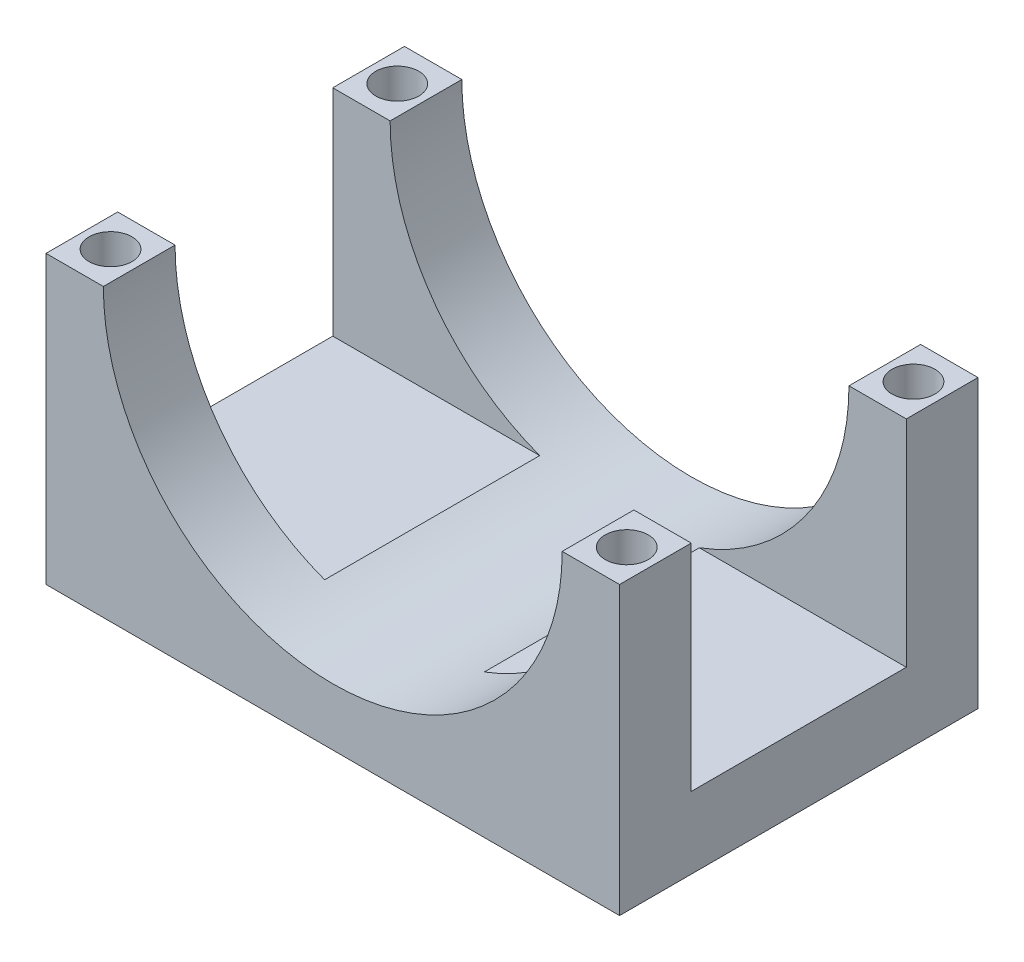
ISO-10303-21;
HEADER;
FILE_DESCRIPTION(('STEP AP214'),'2;1');
FILE_NAME('part.step','',(''),(''),'','','');
FILE_SCHEMA(('AUTOMOTIVE_DESIGN { 1 0 10303 214 1 1 1 1 }'));
ENDSEC;
DATA;
#1=APPLICATION_CONTEXT('core data for automotive mechanical design processes');
#2=APPLICATION_PROTOCOL_DEFINITION('international standard','automotive_design',2000,#1);
#3=PRODUCT_CONTEXT('',#1,'mechanical');
#4=PRODUCT('Part','Part','',(#3));
#5=PRODUCT_RELATED_PRODUCT_CATEGORY('part','',(#4));
#6=PRODUCT_DEFINITION_FORMATION('','',#4);
#7=PRODUCT_DEFINITION_CONTEXT('part definition',#1,'design');
#8=PRODUCT_DEFINITION('design','',#6,#7);
#9=PRODUCT_DEFINITION_SHAPE('','',#8);
#10=(LENGTH_UNIT() NAMED_UNIT(*) SI_UNIT(.MILLI.,.METRE.));
#11=(NAMED_UNIT(*) PLANE_ANGLE_UNIT() SI_UNIT($,.RADIAN.));
#12=(NAMED_UNIT(*) SI_UNIT($,.STERADIAN.) SOLID_ANGLE_UNIT());
#13=UNCERTAINTY_MEASURE_WITH_UNIT(LENGTH_MEASURE(1.E-05),#10,'distance_accuracy_value','');
#14=(GEOMETRIC_REPRESENTATION_CONTEXT(3) GLOBAL_UNCERTAINTY_ASSIGNED_CONTEXT((#13)) GLOBAL_UNIT_ASSIGNED_CONTEXT((#10,
#11,#12)) REPRESENTATION_CONTEXT('',''));
#15=CARTESIAN_POINT('',(0.,0.,0.));
#16=DIRECTION('',(0.,0.,1.));
#17=DIRECTION('',(1.,0.,0.));
#18=AXIS2_PLACEMENT_3D('',#15,#16,#17);
#19=CARTESIAN_POINT('',(0.,20.,0.));
#20=DIRECTION('',(0.,-1.,0.));
#21=DIRECTION('',(0.,0.,-1.));
#22=AXIS2_PLACEMENT_3D('',#19,#20,#21);
#23=PLANE('',#22);
#24=CARTESIAN_POINT('',(38.,20.,-22.5));
#25=DIRECTION('',(0.,1.,0.));
#26=DIRECTION('',(0.,0.,1.));
#27=AXIS2_PLACEMENT_3D('',#24,#25,#26);
#28=CIRCLE('',#27,1.5);
#29=CARTESIAN_POINT('',(38.,20.,-21.));
#30=VERTEX_POINT('',#29);
#31=EDGE_CURVE('E236',#30,#30,#28,.T.);
#32=ORIENTED_EDGE('',*,*,#31,.F.);
#33=EDGE_LOOP('',(#32));
#34=FACE_BOUND('',#33,.T.);
#35=DIRECTION('',(0.,0.,1.));
#36=VECTOR('',#35,1.);
#37=CARTESIAN_POINT('',(36.,20.,-25.));
#38=LINE('',#37,#36);
#39=CARTESIAN_POINT('',(36.,20.,-25.));
#40=VERTEX_POINT('',#39);
#41=CARTESIAN_POINT('',(36.,20.,-20.));
#42=VERTEX_POINT('',#41);
#43=EDGE_CURVE('E199',#40,#42,#38,.T.);
#44=ORIENTED_EDGE('',*,*,#43,.T.);
#45=DIRECTION('',(1.,0.,0.));
#46=VECTOR('',#45,1.);
#47=CARTESIAN_POINT('',(0.,20.,-20.));
#48=LINE('',#47,#46);
#49=CARTESIAN_POINT('',(40.,20.,-20.));
#50=VERTEX_POINT('',#49);
#51=EDGE_CURVE('E223',#42,#50,#48,.T.);
#52=ORIENTED_EDGE('',*,*,#51,.T.);
#53=DIRECTION('',(0.,0.,-1.));
#54=VECTOR('',#53,1.);
#55=CARTESIAN_POINT('',(40.,20.,0.));
#56=LINE('',#55,#54);
#57=CARTESIAN_POINT('',(40.,20.,-25.));
#58=VERTEX_POINT('',#57);
#59=EDGE_CURVE('E172',#50,#58,#56,.T.);
#60=ORIENTED_EDGE('',*,*,#59,.T.);
#61=DIRECTION('',(-1.,0.,0.));
#62=VECTOR('',#61,1.);
#63=CARTESIAN_POINT('',(0.,20.,-25.));
#64=LINE('',#63,#62);
#65=EDGE_CURVE('E177',#58,#40,#64,.T.);
#66=ORIENTED_EDGE('',*,*,#65,.T.);
#67=EDGE_LOOP('',(#44,#52,#60,#66));
#68=FACE_BOUND('',#67,.T.);
#69=ADVANCED_FACE('F35',(#34,#68),#23,.F.);
#70=CARTESIAN_POINT('',(2.,20.,-22.5));
#71=DIRECTION('',(0.,1.,0.));
#72=DIRECTION('',(0.,0.,1.));
#73=AXIS2_PLACEMENT_3D('',#70,#71,#72);
#74=CIRCLE('',#73,1.5);
#75=CARTESIAN_POINT('',(2.,20.,-21.));
#76=VERTEX_POINT('',#75);
#77=EDGE_CURVE('E243',#76,#76,#74,.T.);
#78=ORIENTED_EDGE('',*,*,#77,.F.);
#79=EDGE_LOOP('',(#78));
#80=FACE_BOUND('',#79,.T.);
#81=DIRECTION('',(0.,0.,1.));
#82=VECTOR('',#81,1.);
#83=CARTESIAN_POINT('',(0.,20.,0.));
#84=LINE('',#83,#82);
#85=CARTESIAN_POINT('',(0.,20.,-25.));
#86=VERTEX_POINT('',#85);
#87=CARTESIAN_POINT('',(0.,20.,-20.));
#88=VERTEX_POINT('',#87);
#89=EDGE_CURVE('E159',#86,#88,#84,.T.);
#90=ORIENTED_EDGE('',*,*,#89,.T.);
#91=CARTESIAN_POINT('',(3.99999999999999,20.,-20.));
#92=VERTEX_POINT('',#91);
#93=EDGE_CURVE('E227',#88,#92,#48,.T.);
#94=ORIENTED_EDGE('',*,*,#93,.T.);
#95=DIRECTION('',(0.,0.,1.));
#96=VECTOR('',#95,1.);
#97=CARTESIAN_POINT('',(3.99999999999999,20.,-25.));
#98=LINE('',#97,#96);
#99=CARTESIAN_POINT('',(3.99999999999999,20.,-25.));
#100=VERTEX_POINT('',#99);
#101=EDGE_CURVE('E196',#92,#100,#98,.F.);
#102=ORIENTED_EDGE('',*,*,#101,.T.);
#103=EDGE_CURVE('E176',#100,#86,#64,.T.);
#104=ORIENTED_EDGE('',*,*,#103,.T.);
#105=EDGE_LOOP('',(#90,#94,#102,#104));
#106=FACE_BOUND('',#105,.T.);
#107=ADVANCED_FACE('F306',(#80,#106),#23,.F.);
#108=CARTESIAN_POINT('',(38.,20.,-2.5));
#109=DIRECTION('',(0.,1.,0.));
#110=DIRECTION('',(0.,0.,1.));
#111=AXIS2_PLACEMENT_3D('',#108,#109,#110);
#112=CIRCLE('',#111,1.5);
#113=CARTESIAN_POINT('',(38.,20.,-0.999999999999996));
#114=VERTEX_POINT('',#113);
#115=EDGE_CURVE('E235',#114,#114,#112,.T.);
#116=ORIENTED_EDGE('',*,*,#115,.F.);
#117=EDGE_LOOP('',(#116));
#118=FACE_BOUND('',#117,.T.);
#119=CARTESIAN_POINT('',(40.,20.,0.));
#120=VERTEX_POINT('',#119);
#121=CARTESIAN_POINT('',(40.,20.,-5.));
#122=VERTEX_POINT('',#121);
#123=EDGE_CURVE('E173',#120,#122,#56,.T.);
#124=ORIENTED_EDGE('',*,*,#123,.T.);
#125=DIRECTION('',(1.,0.,0.));
#126=VECTOR('',#125,1.);
#127=CARTESIAN_POINT('',(0.,20.,-5.));
#128=LINE('',#127,#126);
#129=CARTESIAN_POINT('',(36.,20.,-5.));
#130=VERTEX_POINT('',#129);
#131=EDGE_CURVE('E153',#130,#122,#128,.T.);
#132=ORIENTED_EDGE('',*,*,#131,.F.);
#133=CARTESIAN_POINT('',(36.,20.,0.));
#134=VERTEX_POINT('',#133);
#135=EDGE_CURVE('E198',#130,#134,#38,.T.);
#136=ORIENTED_EDGE('',*,*,#135,.T.);
#137=DIRECTION('',(1.,0.,0.));
#138=VECTOR('',#137,1.);
#139=CARTESIAN_POINT('',(0.,20.,0.));
#140=LINE('',#139,#138);
#141=EDGE_CURVE('E163',#134,#120,#140,.T.);
#142=ORIENTED_EDGE('',*,*,#141,.T.);
#143=EDGE_LOOP('',(#124,#132,#136,#142));
#144=FACE_BOUND('',#143,.T.);
#145=ADVANCED_FACE('F269',(#118,#144),#23,.F.);
#146=CARTESIAN_POINT('',(0.,20.,0.));
#147=DIRECTION('',(1.,0.,0.));
#148=DIRECTION('',(0.,0.,-1.));
#149=AXIS2_PLACEMENT_3D('',#146,#147,#148);
#150=PLANE('',#149);
#151=DIRECTION('',(0.,0.,-1.));
#152=VECTOR('',#151,1.);
#153=CARTESIAN_POINT('',(0.,5.,-5.));
#154=LINE('',#153,#152);
#155=CARTESIAN_POINT('',(0.,5.,-5.));
#156=VERTEX_POINT('',#155);
#157=CARTESIAN_POINT('',(0.,5.,-20.));
#158=VERTEX_POINT('',#157);
#159=EDGE_CURVE('E143',#156,#158,#154,.T.);
#160=ORIENTED_EDGE('',*,*,#159,.T.);
#161=DIRECTION('',(0.,1.,0.));
#162=VECTOR('',#161,1.);
#163=CARTESIAN_POINT('',(0.,5.,-20.));
#164=LINE('',#163,#162);
#165=EDGE_CURVE('E222',#158,#88,#164,.T.);
#166=ORIENTED_EDGE('',*,*,#165,.T.);
#167=ORIENTED_EDGE('',*,*,#89,.F.);
#168=DIRECTION('',(0.,-1.,0.));
#169=VECTOR('',#168,1.);
#170=CARTESIAN_POINT('',(0.,20.,-25.));
#171=LINE('',#170,#169);
#172=CARTESIAN_POINT('',(0.,0.,-25.));
#173=VERTEX_POINT('',#172);
#174=EDGE_CURVE('E180',#86,#173,#171,.T.);
#175=ORIENTED_EDGE('',*,*,#174,.T.);
#176=DIRECTION('',(0.,0.,1.));
#177=VECTOR('',#176,1.);
#178=CARTESIAN_POINT('',(0.,0.,0.));
#179=LINE('',#178,#177);
#180=CARTESIAN_POINT('',(0.,0.,0.));
#181=VERTEX_POINT('',#180);
#182=EDGE_CURVE('E181',#173,#181,#179,.T.);
#183=ORIENTED_EDGE('',*,*,#182,.T.);
#184=DIRECTION('',(0.,-1.,0.));
#185=VECTOR('',#184,1.);
#186=CARTESIAN_POINT('',(0.,20.,0.));
#187=LINE('',#186,#185);
#188=CARTESIAN_POINT('',(0.,20.,0.));
#189=VERTEX_POINT('',#188);
#190=EDGE_CURVE('E158',#189,#181,#187,.T.);
#191=ORIENTED_EDGE('',*,*,#190,.F.);
#192=CARTESIAN_POINT('',(0.,20.,-5.));
#193=VERTEX_POINT('',#192);
#194=EDGE_CURVE('E150',#193,#189,#84,.T.);
#195=ORIENTED_EDGE('',*,*,#194,.F.);
#196=DIRECTION('',(0.,-1.,0.));
#197=VECTOR('',#196,1.);
#198=CARTESIAN_POINT('',(0.,20.,-5.));
#199=LINE('',#198,#197);
#200=EDGE_CURVE('E135',#193,#156,#199,.T.);
#201=ORIENTED_EDGE('',*,*,#200,.T.);
#202=EDGE_LOOP('',(#160,#166,#167,#175,#183,#191,#195,#201));
#203=FACE_BOUND('',#202,.T.);
#204=ADVANCED_FACE('F37',(#203),#150,.F.);
#205=CARTESIAN_POINT('',(0.,20.,0.));
#206=DIRECTION('',(0.,0.,-1.));
#207=DIRECTION('',(-1.,0.,0.));
#208=AXIS2_PLACEMENT_3D('',#205,#206,#207);
#209=PLANE('',#208);
#210=ORIENTED_EDGE('',*,*,#141,.F.);
#211=CARTESIAN_POINT('',(20.,20.,0.));
#212=DIRECTION('',(0.,0.,1.));
#213=DIRECTION('',(1.,0.,0.));
#214=AXIS2_PLACEMENT_3D('',#211,#212,#213);
#215=CIRCLE('',#214,16.);
#216=CARTESIAN_POINT('',(3.99999999999999,20.,0.));
#217=VERTEX_POINT('',#216);
#218=EDGE_CURVE('E168',#217,#134,#215,.T.);
#219=ORIENTED_EDGE('',*,*,#218,.F.);
#220=EDGE_CURVE('E170',#189,#217,#140,.T.);
#221=ORIENTED_EDGE('',*,*,#220,.F.);
#222=ORIENTED_EDGE('',*,*,#190,.T.);
#223=DIRECTION('',(1.,0.,0.));
#224=VECTOR('',#223,1.);
#225=CARTESIAN_POINT('',(0.,0.,0.));
#226=LINE('',#225,#224);
#227=CARTESIAN_POINT('',(40.,0.,0.));
#228=VERTEX_POINT('',#227);
#229=EDGE_CURVE('E183',#181,#228,#226,.T.);
#230=ORIENTED_EDGE('',*,*,#229,.T.);
#231=DIRECTION('',(0.,-1.,0.));
#232=VECTOR('',#231,1.);
#233=CARTESIAN_POINT('',(40.,20.,0.));
#234=LINE('',#233,#232);
#235=EDGE_CURVE('E192',#120,#228,#234,.T.);
#236=ORIENTED_EDGE('',*,*,#235,.F.);
#237=EDGE_LOOP('',(#210,#219,#221,#222,#230,#236));
#238=FACE_BOUND('',#237,.T.);
#239=ADVANCED_FACE('F266',(#238),#209,.F.);
#240=CARTESIAN_POINT('',(40.,20.,0.));
#241=DIRECTION('',(-1.,0.,0.));
#242=DIRECTION('',(0.,0.,1.));
#243=AXIS2_PLACEMENT_3D('',#240,#241,#242);
#244=PLANE('',#243);
#245=ORIENTED_EDGE('',*,*,#59,.F.);
#246=DIRECTION('',(0.,1.,0.));
#247=VECTOR('',#246,1.);
#248=CARTESIAN_POINT('',(40.,5.,-20.));
#249=LINE('',#248,#247);
#250=CARTESIAN_POINT('',(40.,5.,-20.));
#251=VERTEX_POINT('',#250);
#252=EDGE_CURVE('E144',#251,#50,#249,.T.);
#253=ORIENTED_EDGE('',*,*,#252,.F.);
#254=DIRECTION('',(0.,0.,-1.));
#255=VECTOR('',#254,1.);
#256=CARTESIAN_POINT('',(40.,5.,-5.));
#257=LINE('',#256,#255);
#258=CARTESIAN_POINT('',(40.,5.,-5.));
#259=VERTEX_POINT('',#258);
#260=EDGE_CURVE('E278',#259,#251,#257,.T.);
#261=ORIENTED_EDGE('',*,*,#260,.F.);
#262=DIRECTION('',(0.,-1.,0.));
#263=VECTOR('',#262,1.);
#264=CARTESIAN_POINT('',(40.,20.,-5.));
#265=LINE('',#264,#263);
#266=EDGE_CURVE('E276',#122,#259,#265,.T.);
#267=ORIENTED_EDGE('',*,*,#266,.F.);
#268=ORIENTED_EDGE('',*,*,#123,.F.);
#269=ORIENTED_EDGE('',*,*,#235,.T.);
#270=DIRECTION('',(0.,0.,-1.));
#271=VECTOR('',#270,1.);
#272=CARTESIAN_POINT('',(40.,0.,0.));
#273=LINE('',#272,#271);
#274=CARTESIAN_POINT('',(40.,0.,-25.));
#275=VERTEX_POINT('',#274);
#276=EDGE_CURVE('E164',#228,#275,#273,.T.);
#277=ORIENTED_EDGE('',*,*,#276,.T.);
#278=DIRECTION('',(0.,-1.,0.));
#279=VECTOR('',#278,1.);
#280=CARTESIAN_POINT('',(40.,20.,-25.));
#281=LINE('',#280,#279);
#282=EDGE_CURVE('E189',#58,#275,#281,.T.);
#283=ORIENTED_EDGE('',*,*,#282,.F.);
#284=EDGE_LOOP('',(#245,#253,#261,#267,#268,#269,#277,#283));
#285=FACE_BOUND('',#284,.T.);
#286=ADVANCED_FACE('F289',(#285),#244,.F.);
#287=CARTESIAN_POINT('',(0.,20.,-25.));
#288=DIRECTION('',(0.,0.,1.));
#289=DIRECTION('',(1.,0.,0.));
#290=AXIS2_PLACEMENT_3D('',#287,#288,#289);
#291=PLANE('',#290);
#292=ORIENTED_EDGE('',*,*,#103,.F.);
#293=CARTESIAN_POINT('',(20.,20.,-25.));
#294=DIRECTION('',(0.,0.,1.));
#295=DIRECTION('',(1.,0.,0.));
#296=AXIS2_PLACEMENT_3D('',#293,#294,#295);
#297=CIRCLE('',#296,16.);
#298=EDGE_CURVE('E184',#100,#40,#297,.T.);
#299=ORIENTED_EDGE('',*,*,#298,.T.);
#300=ORIENTED_EDGE('',*,*,#65,.F.);
#301=ORIENTED_EDGE('',*,*,#282,.T.);
#302=DIRECTION('',(-1.,0.,0.));
#303=VECTOR('',#302,1.);
#304=CARTESIAN_POINT('',(0.,0.,-25.));
#305=LINE('',#304,#303);
#306=EDGE_CURVE('E160',#275,#173,#305,.T.);
#307=ORIENTED_EDGE('',*,*,#306,.T.);
#308=ORIENTED_EDGE('',*,*,#174,.F.);
#309=EDGE_LOOP('',(#292,#299,#300,#301,#307,#308));
#310=FACE_BOUND('',#309,.T.);
#311=ADVANCED_FACE('F292',(#310),#291,.F.);
#312=CARTESIAN_POINT('',(2.,20.,-2.5));
#313=DIRECTION('',(0.,1.,0.));
#314=DIRECTION('',(0.,0.,1.));
#315=AXIS2_PLACEMENT_3D('',#312,#313,#314);
#316=CIRCLE('',#315,1.5);
#317=CARTESIAN_POINT('',(2.,20.,-1.));
#318=VERTEX_POINT('',#317);
#319=EDGE_CURVE('E242',#318,#318,#316,.T.);
#320=ORIENTED_EDGE('',*,*,#319,.F.);
#321=EDGE_LOOP('',(#320));
#322=FACE_BOUND('',#321,.T.);
#323=CARTESIAN_POINT('',(3.99999999999999,20.,-5.));
#324=VERTEX_POINT('',#323);
#325=EDGE_CURVE('E152',#217,#324,#98,.F.);
#326=ORIENTED_EDGE('',*,*,#325,.T.);
#327=EDGE_CURVE('E59',#193,#324,#128,.T.);
#328=ORIENTED_EDGE('',*,*,#327,.F.);
#329=ORIENTED_EDGE('',*,*,#194,.T.);
#330=ORIENTED_EDGE('',*,*,#220,.T.);
#331=EDGE_LOOP('',(#326,#328,#329,#330));
#332=FACE_BOUND('',#331,.T.);
#333=ADVANCED_FACE('F148',(#322,#332),#23,.F.);
#334=CARTESIAN_POINT('',(0.,0.,0.));
#335=DIRECTION('',(0.,-1.,0.));
#336=DIRECTION('',(0.,0.,-1.));
#337=AXIS2_PLACEMENT_3D('',#334,#335,#336);
#338=PLANE('',#337);
#339=CARTESIAN_POINT('',(2.,0.,-22.5));
#340=DIRECTION('',(0.,1.,0.));
#341=DIRECTION('',(0.,0.,1.));
#342=AXIS2_PLACEMENT_3D('',#339,#340,#341);
#343=CIRCLE('',#342,1.5);
#344=CARTESIAN_POINT('',(2.,0.,-21.));
#345=VERTEX_POINT('',#344);
#346=EDGE_CURVE('E239',#345,#345,#343,.T.);
#347=ORIENTED_EDGE('',*,*,#346,.T.);
#348=EDGE_LOOP('',(#347));
#349=FACE_BOUND('',#348,.T.);
#350=CARTESIAN_POINT('',(38.,0.,-2.5));
#351=DIRECTION('',(0.,1.,0.));
#352=DIRECTION('',(0.,0.,1.));
#353=AXIS2_PLACEMENT_3D('',#350,#351,#352);
#354=CIRCLE('',#353,1.5);
#355=CARTESIAN_POINT('',(38.,0.,-0.999999999999996));
#356=VERTEX_POINT('',#355);
#357=EDGE_CURVE('E246',#356,#356,#354,.T.);
#358=ORIENTED_EDGE('',*,*,#357,.T.);
#359=EDGE_LOOP('',(#358));
#360=FACE_BOUND('',#359,.T.);
#361=CARTESIAN_POINT('',(38.,0.,-22.5));
#362=DIRECTION('',(0.,1.,0.));
#363=DIRECTION('',(0.,0.,1.));
#364=AXIS2_PLACEMENT_3D('',#361,#362,#363);
#365=CIRCLE('',#364,1.5);
#366=CARTESIAN_POINT('',(38.,0.,-21.));
#367=VERTEX_POINT('',#366);
#368=EDGE_CURVE('E232',#367,#367,#365,.T.);
#369=ORIENTED_EDGE('',*,*,#368,.T.);
#370=EDGE_LOOP('',(#369));
#371=FACE_BOUND('',#370,.T.);
#372=CARTESIAN_POINT('',(2.,0.,-2.5));
#373=DIRECTION('',(0.,1.,0.));
#374=DIRECTION('',(0.,0.,1.));
#375=AXIS2_PLACEMENT_3D('',#372,#373,#374);
#376=CIRCLE('',#375,1.5);
#377=CARTESIAN_POINT('',(2.,0.,-1.));
#378=VERTEX_POINT('',#377);
#379=EDGE_CURVE('E251',#378,#378,#376,.T.);
#380=ORIENTED_EDGE('',*,*,#379,.T.);
#381=EDGE_LOOP('',(#380));
#382=FACE_BOUND('',#381,.T.);
#383=ORIENTED_EDGE('',*,*,#182,.F.);
#384=ORIENTED_EDGE('',*,*,#306,.F.);
#385=ORIENTED_EDGE('',*,*,#276,.F.);
#386=ORIENTED_EDGE('',*,*,#229,.F.);
#387=EDGE_LOOP('',(#383,#384,#385,#386));
#388=FACE_BOUND('',#387,.T.);
#389=ADVANCED_FACE('F300',(#349,#360,#371,#382,#388),#338,.T.);
#390=CARTESIAN_POINT('',(20.,20.,-25.));
#391=DIRECTION('',(0.,0.,1.));
#392=DIRECTION('',(1.,0.,0.));
#393=AXIS2_PLACEMENT_3D('',#390,#391,#392);
#394=CYLINDRICAL_SURFACE('',#393,16.);
#395=ORIENTED_EDGE('',*,*,#101,.F.);
#396=CARTESIAN_POINT('',(20.,20.,-20.));
#397=DIRECTION('',(0.,0.,-1.));
#398=DIRECTION('',(-1.,0.,0.));
#399=AXIS2_PLACEMENT_3D('',#396,#397,#398);
#400=CIRCLE('',#399,16.);
#401=CARTESIAN_POINT('',(14.43223563717,5.,-20.));
#402=VERTEX_POINT('',#401);
#403=EDGE_CURVE('E11',#92,#402,#400,.F.);
#404=ORIENTED_EDGE('',*,*,#403,.T.);
#405=DIRECTION('',(0.,0.,1.));
#406=VECTOR('',#405,1.);
#407=CARTESIAN_POINT('',(14.43223563717,5.,-25.));
#408=LINE('',#407,#406);
#409=CARTESIAN_POINT('',(14.43223563717,5.,-5.));
#410=VERTEX_POINT('',#409);
#411=EDGE_CURVE('E39',#402,#410,#408,.T.);
#412=ORIENTED_EDGE('',*,*,#411,.T.);
#413=CARTESIAN_POINT('',(20.,20.,-5.));
#414=DIRECTION('',(0.,0.,1.));
#415=DIRECTION('',(0.,-1.,0.));
#416=AXIS2_PLACEMENT_3D('',#413,#414,#415);
#417=CIRCLE('',#416,16.);
#418=EDGE_CURVE('E206',#410,#324,#417,.F.);
#419=ORIENTED_EDGE('',*,*,#418,.T.);
#420=ORIENTED_EDGE('',*,*,#325,.F.);
#421=ORIENTED_EDGE('',*,*,#218,.T.);
#422=ORIENTED_EDGE('',*,*,#135,.F.);
#423=CARTESIAN_POINT('',(25.56776436283,5.,-5.));
#424=VERTEX_POINT('',#423);
#425=EDGE_CURVE('E202',#130,#424,#417,.F.);
#426=ORIENTED_EDGE('',*,*,#425,.T.);
#427=DIRECTION('',(0.,0.,1.));
#428=VECTOR('',#427,1.);
#429=CARTESIAN_POINT('',(25.56776436283,5.,-25.));
#430=LINE('',#429,#428);
#431=CARTESIAN_POINT('',(25.56776436283,5.,-20.));
#432=VERTEX_POINT('',#431);
#433=EDGE_CURVE('E205',#424,#432,#430,.F.);
#434=ORIENTED_EDGE('',*,*,#433,.T.);
#435=EDGE_CURVE('E44',#432,#42,#400,.F.);
#436=ORIENTED_EDGE('',*,*,#435,.T.);
#437=ORIENTED_EDGE('',*,*,#43,.F.);
#438=ORIENTED_EDGE('',*,*,#298,.F.);
#439=EDGE_LOOP('',(#395,#404,#412,#419,#420,#421,#422,#426,#434,#436,#437,#438));
#440=FACE_BOUND('',#439,.T.);
#441=ADVANCED_FACE('F212',(#440),#394,.F.);
#442=CARTESIAN_POINT('',(2.,0.,-2.5));
#443=DIRECTION('',(0.,1.,0.));
#444=DIRECTION('',(0.,0.,1.));
#445=AXIS2_PLACEMENT_3D('',#442,#443,#444);
#446=CYLINDRICAL_SURFACE('',#445,1.5);
#447=ORIENTED_EDGE('',*,*,#379,.F.);
#448=EDGE_LOOP('',(#447));
#449=FACE_BOUND('',#448,.T.);
#450=ORIENTED_EDGE('',*,*,#319,.T.);
#451=EDGE_LOOP('',(#450));
#452=FACE_BOUND('',#451,.T.);
#453=ADVANCED_FACE('F320',(#449,#452),#446,.F.);
#454=CARTESIAN_POINT('',(38.,0.,-22.5));
#455=DIRECTION('',(0.,1.,0.));
#456=DIRECTION('',(0.,0.,1.));
#457=AXIS2_PLACEMENT_3D('',#454,#455,#456);
#458=CYLINDRICAL_SURFACE('',#457,1.5);
#459=ORIENTED_EDGE('',*,*,#368,.F.);
#460=EDGE_LOOP('',(#459));
#461=FACE_BOUND('',#460,.T.);
#462=ORIENTED_EDGE('',*,*,#31,.T.);
#463=EDGE_LOOP('',(#462));
#464=FACE_BOUND('',#463,.T.);
#465=ADVANCED_FACE('F431',(#461,#464),#458,.F.);
#466=CARTESIAN_POINT('',(38.,0.,-2.5));
#467=DIRECTION('',(0.,1.,0.));
#468=DIRECTION('',(0.,0.,1.));
#469=AXIS2_PLACEMENT_3D('',#466,#467,#468);
#470=CYLINDRICAL_SURFACE('',#469,1.5);
#471=ORIENTED_EDGE('',*,*,#357,.F.);
#472=EDGE_LOOP('',(#471));
#473=FACE_BOUND('',#472,.T.);
#474=ORIENTED_EDGE('',*,*,#115,.T.);
#475=EDGE_LOOP('',(#474));
#476=FACE_BOUND('',#475,.T.);
#477=ADVANCED_FACE('F342',(#473,#476),#470,.F.);
#478=CARTESIAN_POINT('',(2.,0.,-22.5));
#479=DIRECTION('',(0.,1.,0.));
#480=DIRECTION('',(0.,0.,1.));
#481=AXIS2_PLACEMENT_3D('',#478,#479,#480);
#482=CYLINDRICAL_SURFACE('',#481,1.5);
#483=ORIENTED_EDGE('',*,*,#346,.F.);
#484=EDGE_LOOP('',(#483));
#485=FACE_BOUND('',#484,.T.);
#486=ORIENTED_EDGE('',*,*,#77,.T.);
#487=EDGE_LOOP('',(#486));
#488=FACE_BOUND('',#487,.T.);
#489=ADVANCED_FACE('F334',(#485,#488),#482,.F.);
#490=CARTESIAN_POINT('',(0.,20.,-5.));
#491=DIRECTION('',(0.,0.,1.));
#492=DIRECTION('',(0.,-1.,0.));
#493=AXIS2_PLACEMENT_3D('',#490,#491,#492);
#494=PLANE('',#493);
#495=ORIENTED_EDGE('',*,*,#131,.T.);
#496=ORIENTED_EDGE('',*,*,#266,.T.);
#497=DIRECTION('',(1.,0.,0.));
#498=VECTOR('',#497,1.);
#499=CARTESIAN_POINT('',(0.,5.,-5.));
#500=LINE('',#499,#498);
#501=EDGE_CURVE('E51',#424,#259,#500,.T.);
#502=ORIENTED_EDGE('',*,*,#501,.F.);
#503=ORIENTED_EDGE('',*,*,#425,.F.);
#504=EDGE_LOOP('',(#495,#496,#502,#503));
#505=FACE_BOUND('',#504,.T.);
#506=ADVANCED_FACE('F331',(#505),#494,.F.);
#507=CARTESIAN_POINT('',(0.,5.,-5.));
#508=DIRECTION('',(0.,-1.,0.));
#509=DIRECTION('',(0.,0.,-1.));
#510=AXIS2_PLACEMENT_3D('',#507,#508,#509);
#511=PLANE('',#510);
#512=ORIENTED_EDGE('',*,*,#501,.T.);
#513=ORIENTED_EDGE('',*,*,#260,.T.);
#514=DIRECTION('',(1.,0.,0.));
#515=VECTOR('',#514,1.);
#516=CARTESIAN_POINT('',(0.,5.,-20.));
#517=LINE('',#516,#515);
#518=EDGE_CURVE('E224',#432,#251,#517,.T.);
#519=ORIENTED_EDGE('',*,*,#518,.F.);
#520=ORIENTED_EDGE('',*,*,#433,.F.);
#521=EDGE_LOOP('',(#512,#513,#519,#520));
#522=FACE_BOUND('',#521,.T.);
#523=ADVANCED_FACE('F333',(#522),#511,.F.);
#524=CARTESIAN_POINT('',(0.,5.,-20.));
#525=DIRECTION('',(0.,0.,-1.));
#526=DIRECTION('',(-1.,0.,0.));
#527=AXIS2_PLACEMENT_3D('',#524,#525,#526);
#528=PLANE('',#527);
#529=ORIENTED_EDGE('',*,*,#518,.T.);
#530=ORIENTED_EDGE('',*,*,#252,.T.);
#531=ORIENTED_EDGE('',*,*,#51,.F.);
#532=ORIENTED_EDGE('',*,*,#435,.F.);
#533=EDGE_LOOP('',(#529,#530,#531,#532));
#534=FACE_BOUND('',#533,.T.);
#535=ADVANCED_FACE('F282',(#534),#528,.F.);
#536=ORIENTED_EDGE('',*,*,#93,.F.);
#537=ORIENTED_EDGE('',*,*,#165,.F.);
#538=EDGE_CURVE('E216',#158,#402,#517,.T.);
#539=ORIENTED_EDGE('',*,*,#538,.T.);
#540=ORIENTED_EDGE('',*,*,#403,.F.);
#541=EDGE_LOOP('',(#536,#537,#539,#540));
#542=FACE_BOUND('',#541,.T.);
#543=ADVANCED_FACE('F219',(#542),#528,.F.);
#544=ORIENTED_EDGE('',*,*,#538,.F.);
#545=ORIENTED_EDGE('',*,*,#159,.F.);
#546=EDGE_CURVE('E138',#156,#410,#500,.T.);
#547=ORIENTED_EDGE('',*,*,#546,.T.);
#548=ORIENTED_EDGE('',*,*,#411,.F.);
#549=EDGE_LOOP('',(#544,#545,#547,#548));
#550=FACE_BOUND('',#549,.T.);
#551=ADVANCED_FACE('F215',(#550),#511,.F.);
#552=ORIENTED_EDGE('',*,*,#546,.F.);
#553=ORIENTED_EDGE('',*,*,#200,.F.);
#554=ORIENTED_EDGE('',*,*,#327,.T.);
#555=ORIENTED_EDGE('',*,*,#418,.F.);
#556=EDGE_LOOP('',(#552,#553,#554,#555));
#557=FACE_BOUND('',#556,.T.);
#558=ADVANCED_FACE('F136',(#557),#494,.F.);
#559=CLOSED_SHELL('',(#69,#107,#145,#204,#239,#286,#311,#333,#389,#441,#453,#465,#477,#489,#506,
#523,#535,#543,#551,#558));
#560=MANIFOLD_SOLID_BREP('B2',#559);
#561=ADVANCED_BREP_SHAPE_REPRESENTATION('',(#18,#560),#14);
#562=SHAPE_DEFINITION_REPRESENTATION(#9,#561);
ENDSEC;
END-ISO-10303-21;
